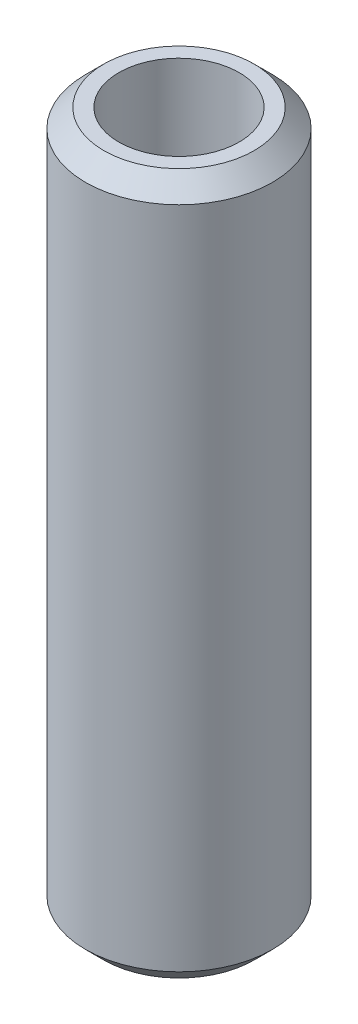
ISO-10303-21;
HEADER;
FILE_DESCRIPTION(('STEP AP214'),'2;1');
FILE_NAME('part.step','',(''),(''),'','','');
FILE_SCHEMA(('AUTOMOTIVE_DESIGN { 1 0 10303 214 1 1 1 1 }'));
ENDSEC;
DATA;
#1=APPLICATION_CONTEXT('core data for automotive mechanical design processes');
#2=APPLICATION_PROTOCOL_DEFINITION('international standard','automotive_design',2000,#1);
#3=PRODUCT_CONTEXT('',#1,'mechanical');
#4=PRODUCT('Part','Part','',(#3));
#5=PRODUCT_RELATED_PRODUCT_CATEGORY('part','',(#4));
#6=PRODUCT_DEFINITION_FORMATION('','',#4);
#7=PRODUCT_DEFINITION_CONTEXT('part definition',#1,'design');
#8=PRODUCT_DEFINITION('design','',#6,#7);
#9=PRODUCT_DEFINITION_SHAPE('','',#8);
#10=(LENGTH_UNIT() NAMED_UNIT(*) SI_UNIT(.MILLI.,.METRE.));
#11=(NAMED_UNIT(*) PLANE_ANGLE_UNIT() SI_UNIT($,.RADIAN.));
#12=(NAMED_UNIT(*) SI_UNIT($,.STERADIAN.) SOLID_ANGLE_UNIT());
#13=UNCERTAINTY_MEASURE_WITH_UNIT(LENGTH_MEASURE(1.E-05),#10,'distance_accuracy_value','');
#14=(GEOMETRIC_REPRESENTATION_CONTEXT(3) GLOBAL_UNCERTAINTY_ASSIGNED_CONTEXT((#13)) GLOBAL_UNIT_ASSIGNED_CONTEXT((#10,
#11,#12)) REPRESENTATION_CONTEXT('',''));
#15=CARTESIAN_POINT('',(0.,0.,0.));
#16=DIRECTION('',(0.,0.,1.));
#17=DIRECTION('',(1.,0.,0.));
#18=AXIS2_PLACEMENT_3D('',#15,#16,#17);
#19=CARTESIAN_POINT('',(0.,93.7682273624639,0.));
#20=DIRECTION('',(0.,-1.,0.));
#21=DIRECTION('',(0.,0.,-1.));
#22=AXIS2_PLACEMENT_3D('',#19,#20,#21);
#23=CYLINDRICAL_SURFACE('',#22,12.5);
#24=CARTESIAN_POINT('',(0.,91.3167197651791,0.));
#25=DIRECTION('',(0.,1.,0.));
#26=DIRECTION('',(0.,0.,1.));
#27=AXIS2_PLACEMENT_3D('',#24,#25,#26);
#28=CIRCLE('',#27,12.5);
#29=CARTESIAN_POINT('',(0.,91.3167197651791,12.5));
#30=VERTEX_POINT('',#29);
#31=EDGE_CURVE('E50',#30,#30,#28,.F.);
#32=ORIENTED_EDGE('',*,*,#31,.T.);
#33=EDGE_LOOP('',(#32));
#34=FACE_BOUND('',#33,.T.);
#35=CARTESIAN_POINT('',(0.,2.45150759728478,0.));
#36=DIRECTION('',(0.,1.,0.));
#37=DIRECTION('',(0.,0.,1.));
#38=AXIS2_PLACEMENT_3D('',#35,#36,#37);
#39=CIRCLE('',#38,12.5);
#40=CARTESIAN_POINT('',(0.,2.45150759728478,12.5));
#41=VERTEX_POINT('',#40);
#42=EDGE_CURVE('E51',#41,#41,#39,.T.);
#43=ORIENTED_EDGE('',*,*,#42,.T.);
#44=EDGE_LOOP('',(#43));
#45=FACE_BOUND('',#44,.T.);
#46=ADVANCED_FACE('F39',(#34,#45),#23,.T.);
#47=CARTESIAN_POINT('',(0.,93.7682273624639,0.));
#48=DIRECTION('',(0.,1.,0.));
#49=DIRECTION('',(0.,0.,1.));
#50=AXIS2_PLACEMENT_3D('',#47,#48,#49);
#51=PLANE('',#50);
#52=CARTESIAN_POINT('',(0.,93.7682273624639,0.));
#53=DIRECTION('',(0.,1.,0.));
#54=DIRECTION('',(0.,0.,1.));
#55=AXIS2_PLACEMENT_3D('',#52,#53,#54);
#56=CIRCLE('',#55,10.0484924027152);
#57=CARTESIAN_POINT('',(0.,93.7682273624639,10.0484924027152));
#58=VERTEX_POINT('',#57);
#59=EDGE_CURVE('E54',#58,#58,#56,.T.);
#60=ORIENTED_EDGE('',*,*,#59,.T.);
#61=EDGE_LOOP('',(#60));
#62=FACE_BOUND('',#61,.T.);
#63=CARTESIAN_POINT('',(0.,93.7682273624639,0.));
#64=DIRECTION('',(0.,1.,0.));
#65=DIRECTION('',(0.,0.,1.));
#66=AXIS2_PLACEMENT_3D('',#63,#64,#65);
#67=CIRCLE('',#66,8.05404856263415);
#68=CARTESIAN_POINT('',(0.,93.7682273624639,8.05404856263415));
#69=VERTEX_POINT('',#68);
#70=EDGE_CURVE('E58',#69,#69,#67,.T.);
#71=ORIENTED_EDGE('',*,*,#70,.F.);
#72=EDGE_LOOP('',(#71));
#73=FACE_BOUND('',#72,.T.);
#74=ADVANCED_FACE('F69',(#62,#73),#51,.T.);
#75=CARTESIAN_POINT('',(0.,0.,0.));
#76=DIRECTION('',(0.,1.,0.));
#77=DIRECTION('',(0.,0.,1.));
#78=AXIS2_PLACEMENT_3D('',#75,#76,#77);
#79=PLANE('',#78);
#80=CARTESIAN_POINT('',(0.,0.,0.));
#81=DIRECTION('',(0.,1.,0.));
#82=DIRECTION('',(0.,0.,1.));
#83=AXIS2_PLACEMENT_3D('',#80,#81,#82);
#84=CIRCLE('',#83,10.0484924027152);
#85=CARTESIAN_POINT('',(0.,0.,10.0484924027152));
#86=VERTEX_POINT('',#85);
#87=EDGE_CURVE('E10',#86,#86,#84,.F.);
#88=ORIENTED_EDGE('',*,*,#87,.T.);
#89=EDGE_LOOP('',(#88));
#90=FACE_BOUND('',#89,.T.);
#91=CARTESIAN_POINT('',(0.,0.,0.));
#92=DIRECTION('',(0.,1.,0.));
#93=DIRECTION('',(0.,0.,1.));
#94=AXIS2_PLACEMENT_3D('',#91,#92,#93);
#95=CIRCLE('',#94,8.05404856263415);
#96=CARTESIAN_POINT('',(0.,0.,8.05404856263415));
#97=VERTEX_POINT('',#96);
#98=EDGE_CURVE('E63',#97,#97,#95,.T.);
#99=ORIENTED_EDGE('',*,*,#98,.T.);
#100=EDGE_LOOP('',(#99));
#101=FACE_BOUND('',#100,.T.);
#102=ADVANCED_FACE('F75',(#90,#101),#79,.F.);
#103=CARTESIAN_POINT('',(0.,93.7682273624639,0.));
#104=DIRECTION('',(0.,-1.,0.));
#105=DIRECTION('',(0.,0.,-1.));
#106=AXIS2_PLACEMENT_3D('',#103,#104,#105);
#107=CYLINDRICAL_SURFACE('',#106,8.05404856263415);
#108=ORIENTED_EDGE('',*,*,#70,.T.);
#109=EDGE_LOOP('',(#108));
#110=FACE_BOUND('',#109,.T.);
#111=ORIENTED_EDGE('',*,*,#98,.F.);
#112=EDGE_LOOP('',(#111));
#113=FACE_BOUND('',#112,.T.);
#114=ADVANCED_FACE('F70',(#110,#113),#107,.F.);
#115=CARTESIAN_POINT('',(0.,93.7682273624639,0.));
#116=DIRECTION('',(0.,-1.,0.));
#117=DIRECTION('',(0.,0.,-1.));
#118=AXIS2_PLACEMENT_3D('',#115,#116,#117);
#119=CONICAL_SURFACE('',#118,10.0484924027152,0.785398163397443);
#120=ORIENTED_EDGE('',*,*,#31,.F.);
#121=EDGE_LOOP('',(#120));
#122=FACE_BOUND('',#121,.T.);
#123=ORIENTED_EDGE('',*,*,#59,.F.);
#124=EDGE_LOOP('',(#123));
#125=FACE_BOUND('',#124,.T.);
#126=ADVANCED_FACE('F81',(#122,#125),#119,.T.);
#127=CARTESIAN_POINT('',(0.,2.45150759728478,0.));
#128=DIRECTION('',(0.,1.,0.));
#129=DIRECTION('',(0.,0.,1.));
#130=AXIS2_PLACEMENT_3D('',#127,#128,#129);
#131=CONICAL_SURFACE('',#130,12.5,0.785398163397453);
#132=CARTESIAN_POINT('',(0.,0.,10.0484924027152));
#133=CARTESIAN_POINT('',(0.,0.0255365374717158,10.0740289401869));
#134=CARTESIAN_POINT('',(0.,0.0510730749434323,10.0995654776586));
#135=CARTESIAN_POINT('',(0.,0.102146149886865,10.1506385526021));
#136=CARTESIAN_POINT('',(0.,0.127682687358582,10.1761750900738));
#137=CARTESIAN_POINT('',(0.,0.178755762302015,10.2272481650172));
#138=CARTESIAN_POINT('',(0.,0.204292299773731,10.2527847024889));
#139=CARTESIAN_POINT('',(0.,0.255365374717164,10.3038577774324));
#140=CARTESIAN_POINT('',(0.,0.280901912188881,10.3293943149041));
#141=CARTESIAN_POINT('',(0.,0.331974987132314,10.3804673898475));
#142=CARTESIAN_POINT('',(0.,0.35751152460403,10.4060039273192));
#143=CARTESIAN_POINT('',(0.,0.408584599547463,10.4570770022627));
#144=CARTESIAN_POINT('',(0.,0.43412113701918,10.4826135397344));
#145=CARTESIAN_POINT('',(0.,0.485194211962613,10.5336866146778));
#146=CARTESIAN_POINT('',(0.,0.510730749434329,10.5592231521495));
#147=CARTESIAN_POINT('',(0.,0.561803824377762,10.610296227093));
#148=CARTESIAN_POINT('',(0.,0.587340361849478,10.6358327645647));
#149=CARTESIAN_POINT('',(0.,0.638413436792911,10.6869058395081));
#150=CARTESIAN_POINT('',(0.,0.663949974264628,10.7124423769798));
#151=CARTESIAN_POINT('',(0.,0.715023049208061,10.7635154519233));
#152=CARTESIAN_POINT('',(0.,0.740559586679778,10.789051989395));
#153=CARTESIAN_POINT('',(0.,0.79163266162321,10.8401250643384));
#154=CARTESIAN_POINT('',(0.,0.817169199094927,10.8656616018101));
#155=CARTESIAN_POINT('',(0.,0.86824227403836,10.9167346767536));
#156=CARTESIAN_POINT('',(0.,0.893778811510077,10.9422712142253));
#157=CARTESIAN_POINT('',(0.,0.94485188645351,10.9933442891687));
#158=CARTESIAN_POINT('',(0.,0.970388423925226,11.0188808266404));
#159=CARTESIAN_POINT('',(0.,1.02146149886866,11.0699539015839));
#160=CARTESIAN_POINT('',(0.,1.04699803634038,11.0954904390556));
#161=CARTESIAN_POINT('',(0.,1.09807111128381,11.146563513999));
#162=CARTESIAN_POINT('',(0.,1.12360764875552,11.1721000514707));
#163=CARTESIAN_POINT('',(0.,1.17468072369896,11.2231731264142));
#164=CARTESIAN_POINT('',(0.,1.20021726117067,11.2487096638859));
#165=CARTESIAN_POINT('',(0.,1.25129033611411,11.2997827388293));
#166=CARTESIAN_POINT('',(0.,1.27682687358582,11.325319276301));
#167=CARTESIAN_POINT('',(0.,1.32789994852926,11.3763923512445));
#168=CARTESIAN_POINT('',(0.,1.35343648600097,11.4019288887162));
#169=CARTESIAN_POINT('',(0.,1.40450956094441,11.4530019636596));
#170=CARTESIAN_POINT('',(0.,1.43004609841612,11.4785385011313));
#171=CARTESIAN_POINT('',(0.,1.48111917335956,11.5296115760748));
#172=CARTESIAN_POINT('',(0.,1.50665571083127,11.5551481135465));
#173=CARTESIAN_POINT('',(0.,1.55772878577471,11.6062211884899));
#174=CARTESIAN_POINT('',(0.,1.58326532324642,11.6317577259616));
#175=CARTESIAN_POINT('',(0.,1.63433839818985,11.6828308009051));
#176=CARTESIAN_POINT('',(0.,1.65987493566157,11.7083673383768));
#177=CARTESIAN_POINT('',(0.,1.710948010605,11.7594404133202));
#178=CARTESIAN_POINT('',(0.,1.73648454807672,11.7849769507919));
#179=CARTESIAN_POINT('',(0.,1.78755762302015,11.8360500257354));
#180=CARTESIAN_POINT('',(0.,1.81309416049187,11.8615865632071));
#181=CARTESIAN_POINT('',(0.,1.8641672354353,11.9126596381505));
#182=CARTESIAN_POINT('',(0.,1.88970377290702,11.9381961756222));
#183=CARTESIAN_POINT('',(0.,1.94077684785045,11.9892692505657));
#184=CARTESIAN_POINT('',(0.,1.96631338532217,12.0148057880374));
#185=CARTESIAN_POINT('',(0.,2.0173864602656,12.0658788629808));
#186=CARTESIAN_POINT('',(0.,2.04292299773732,12.0914154004525));
#187=CARTESIAN_POINT('',(0.,2.09399607268075,12.142488475396));
#188=CARTESIAN_POINT('',(0.,2.11953261015247,12.1680250128677));
#189=CARTESIAN_POINT('',(0.,2.1706056850959,12.2190980878111));
#190=CARTESIAN_POINT('',(0.,2.19614222256762,12.2446346252828));
#191=CARTESIAN_POINT('',(0.,2.24721529751105,12.2957077002263));
#192=CARTESIAN_POINT('',(0.,2.27275183498277,12.321244237698));
#193=CARTESIAN_POINT('',(0.,2.3238249099262,12.3723173126414));
#194=CARTESIAN_POINT('',(0.,2.34936144739792,12.3978538501131));
#195=CARTESIAN_POINT('',(0.,2.40043452234135,12.4489269250566));
#196=CARTESIAN_POINT('',(0.,2.42597105981307,12.4744634625283));
#197=CARTESIAN_POINT('',(0.,2.45150759728478,12.5));
#198=B_SPLINE_CURVE_WITH_KNOTS('',3,(#132,#133,#134,#135,#136,#137,#138,#139,#140,#141,#142,
#143,#144,#145,#146,#147,#148,#149,#150,#151,#152,#153,#154,#155,#156,#157,#158,#159,#160,#161,
#162,#163,#164,#165,#166,#167,#168,#169,#170,#171,#172,#173,#174,#175,#176,#177,#178,#179,#180,
#181,#182,#183,#184,#185,#186,#187,#188,#189,#190,#191,#192,#193,#194,#195,#196,#197),
.UNSPECIFIED.,.F.,.F.,(4,2,2,2,2,2,2,2,2,2,2,2,2,2,2,2,2,2,2,2,2,2,2,2,2,2,2,2,2,2,2,2,4),(0.,
0.108342352885652,0.216684705771303,0.325027058656954,0.433369411542605,0.541711764428256,
0.650054117313907,0.758396470199557,0.86673882308521,0.975081175970861,1.08342352885651,
1.19176588174216,1.30010823462781,1.40845058751347,1.51679294039912,1.62513529328477,
1.73347764617042,1.84181999905607,1.95016235194172,2.05850470482737,2.16684705771302,
2.27518941059867,2.38353176348432,2.49187411636998,2.60021646925563,2.70855882214128,
2.81690117502693,2.92524352791258,3.03358588079823,3.14192823368388,3.25027058656953,
3.35861293945518,3.46695529234084),.UNSPECIFIED.);
#199=EDGE_CURVE('BSEAM45',#86,#41,#198,.T.);
#200=ORIENTED_EDGE('',*,*,#87,.F.);
#201=ORIENTED_EDGE('',*,*,#42,.F.);
#202=ORIENTED_EDGE('',*,*,#199,.T.);
#203=ORIENTED_EDGE('',*,*,#199,.F.);
#204=EDGE_LOOP('',(#200,#202,#201,#203));
#205=FACE_BOUND('',#204,.T.);
#206=ADVANCED_FACE('F45',(#205),#131,.T.);
#207=CLOSED_SHELL('',(#46,#74,#102,#114,#126,#206));
#208=MANIFOLD_SOLID_BREP('B2',#207);
#209=ADVANCED_BREP_SHAPE_REPRESENTATION('',(#18,#208),#14);
#210=SHAPE_DEFINITION_REPRESENTATION(#9,#209);
ENDSEC;
END-ISO-10303-21;
